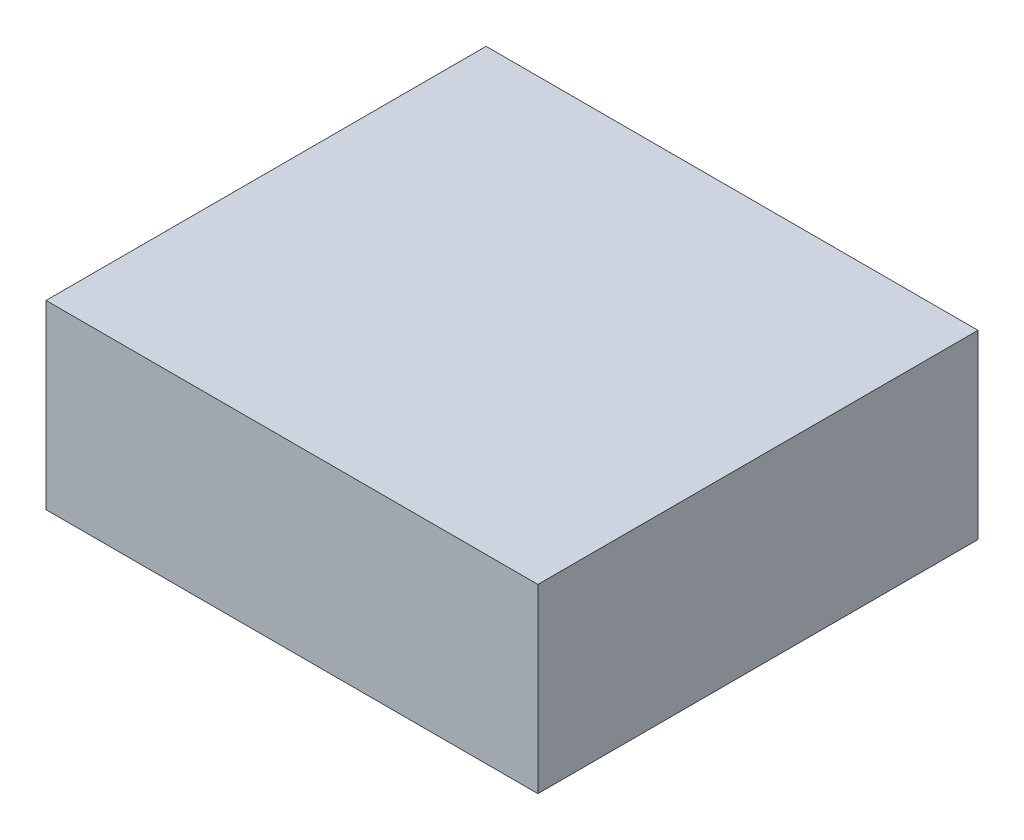
ISO-10303-21;
HEADER;
FILE_DESCRIPTION(('STEP AP214'),'2;1');
FILE_NAME('part.step','',(''),(''),'','','');
FILE_SCHEMA(('AUTOMOTIVE_DESIGN { 1 0 10303 214 1 1 1 1 }'));
ENDSEC;
DATA;
#1=APPLICATION_CONTEXT('core data for automotive mechanical design processes');
#2=APPLICATION_PROTOCOL_DEFINITION('international standard','automotive_design',2000,#1);
#3=PRODUCT_CONTEXT('',#1,'mechanical');
#4=PRODUCT('Part','Part','',(#3));
#5=PRODUCT_RELATED_PRODUCT_CATEGORY('part','',(#4));
#6=PRODUCT_DEFINITION_FORMATION('','',#4);
#7=PRODUCT_DEFINITION_CONTEXT('part definition',#1,'design');
#8=PRODUCT_DEFINITION('design','',#6,#7);
#9=PRODUCT_DEFINITION_SHAPE('','',#8);
#10=(LENGTH_UNIT() NAMED_UNIT(*) SI_UNIT(.MILLI.,.METRE.));
#11=(NAMED_UNIT(*) PLANE_ANGLE_UNIT() SI_UNIT($,.RADIAN.));
#12=(NAMED_UNIT(*) SI_UNIT($,.STERADIAN.) SOLID_ANGLE_UNIT());
#13=UNCERTAINTY_MEASURE_WITH_UNIT(LENGTH_MEASURE(1.E-05),#10,'distance_accuracy_value','');
#14=(GEOMETRIC_REPRESENTATION_CONTEXT(3) GLOBAL_UNCERTAINTY_ASSIGNED_CONTEXT((#13)) GLOBAL_UNIT_ASSIGNED_CONTEXT((#10,
#11,#12)) REPRESENTATION_CONTEXT('',''));
#15=CARTESIAN_POINT('',(0.,0.,0.));
#16=DIRECTION('',(0.,0.,1.));
#17=DIRECTION('',(1.,0.,0.));
#18=AXIS2_PLACEMENT_3D('',#15,#16,#17);
#19=CARTESIAN_POINT('',(-0.47499778,-0.17499838,0.));
#20=DIRECTION('',(0.,1.,0.));
#21=DIRECTION('',(1.,0.,0.));
#22=AXIS2_PLACEMENT_3D('',#19,#20,#21);
#23=PLANE('',#22);
#24=DIRECTION('',(1.,0.,0.));
#25=VECTOR('',#24,1.);
#26=CARTESIAN_POINT('',(-0.47499778,-0.17499838,0.));
#27=LINE('',#26,#25);
#28=CARTESIAN_POINT('',(-0.47499778,-0.17499838,0.));
#29=VERTEX_POINT('',#28);
#30=CARTESIAN_POINT('',(0.47500032,-0.17499838,0.));
#31=VERTEX_POINT('',#30);
#32=EDGE_CURVE('E11',#29,#31,#27,.T.);
#33=ORIENTED_EDGE('',*,*,#32,.T.);
#34=DIRECTION('',(0.,0.,1.));
#35=VECTOR('',#34,1.);
#36=CARTESIAN_POINT('',(0.47500032,-0.17499838,0.));
#37=LINE('',#36,#35);
#38=CARTESIAN_POINT('',(0.47500032,-0.17499838,0.85000084));
#39=VERTEX_POINT('',#38);
#40=EDGE_CURVE('E24',#31,#39,#37,.T.);
#41=ORIENTED_EDGE('',*,*,#40,.T.);
#42=DIRECTION('',(1.,0.,0.));
#43=VECTOR('',#42,1.);
#44=CARTESIAN_POINT('',(-0.47499778,-0.17499838,0.85000084));
#45=LINE('',#44,#43);
#46=CARTESIAN_POINT('',(-0.47499778,-0.17499838,0.85000084));
#47=VERTEX_POINT('',#46);
#48=EDGE_CURVE('E87',#47,#39,#45,.T.);
#49=ORIENTED_EDGE('',*,*,#48,.F.);
#50=DIRECTION('',(0.,0.,1.));
#51=VECTOR('',#50,1.);
#52=CARTESIAN_POINT('',(-0.47499778,-0.17499838,0.));
#53=LINE('',#52,#51);
#54=EDGE_CURVE('E36',#29,#47,#53,.T.);
#55=ORIENTED_EDGE('',*,*,#54,.F.);
#56=EDGE_LOOP('',(#33,#41,#49,#55));
#57=FACE_BOUND('',#56,.T.);
#58=ADVANCED_FACE('F17',(#57),#23,.F.);
#59=CARTESIAN_POINT('',(0.47500032,-0.17499838,0.));
#60=DIRECTION('',(-1.,0.,0.));
#61=DIRECTION('',(0.,1.,0.));
#62=AXIS2_PLACEMENT_3D('',#59,#60,#61);
#63=PLANE('',#62);
#64=DIRECTION('',(0.,1.,0.));
#65=VECTOR('',#64,1.);
#66=CARTESIAN_POINT('',(0.47500032,-0.17499838,0.));
#67=LINE('',#66,#65);
#68=CARTESIAN_POINT('',(0.47500032,0.17500092,0.));
#69=VERTEX_POINT('',#68);
#70=EDGE_CURVE('E84',#31,#69,#67,.T.);
#71=ORIENTED_EDGE('',*,*,#70,.T.);
#72=DIRECTION('',(0.,0.,1.));
#73=VECTOR('',#72,1.);
#74=CARTESIAN_POINT('',(0.47500032,0.17500092,0.));
#75=LINE('',#74,#73);
#76=CARTESIAN_POINT('',(0.47500032,0.17500092,0.85000084));
#77=VERTEX_POINT('',#76);
#78=EDGE_CURVE('E82',#69,#77,#75,.T.);
#79=ORIENTED_EDGE('',*,*,#78,.T.);
#80=DIRECTION('',(0.,1.,0.));
#81=VECTOR('',#80,1.);
#82=CARTESIAN_POINT('',(0.47500032,-0.17499838,0.85000084));
#83=LINE('',#82,#81);
#84=EDGE_CURVE('E62',#39,#77,#83,.T.);
#85=ORIENTED_EDGE('',*,*,#84,.F.);
#86=ORIENTED_EDGE('',*,*,#40,.F.);
#87=EDGE_LOOP('',(#71,#79,#85,#86));
#88=FACE_BOUND('',#87,.T.);
#89=ADVANCED_FACE('F89',(#88),#63,.F.);
#90=CARTESIAN_POINT('',(0.47500032,0.17500092,0.));
#91=DIRECTION('',(0.,-1.,0.));
#92=DIRECTION('',(-1.,0.,0.));
#93=AXIS2_PLACEMENT_3D('',#90,#91,#92);
#94=PLANE('',#93);
#95=DIRECTION('',(-1.,0.,0.));
#96=VECTOR('',#95,1.);
#97=CARTESIAN_POINT('',(0.47500032,0.17500092,0.));
#98=LINE('',#97,#96);
#99=CARTESIAN_POINT('',(-0.47499778,0.17500092,0.));
#100=VERTEX_POINT('',#99);
#101=EDGE_CURVE('E71',#69,#100,#98,.T.);
#102=ORIENTED_EDGE('',*,*,#101,.T.);
#103=DIRECTION('',(0.,0.,1.));
#104=VECTOR('',#103,1.);
#105=CARTESIAN_POINT('',(-0.47499778,0.17500092,0.));
#106=LINE('',#105,#104);
#107=CARTESIAN_POINT('',(-0.47499778,0.17500092,0.85000084));
#108=VERTEX_POINT('',#107);
#109=EDGE_CURVE('E65',#100,#108,#106,.T.);
#110=ORIENTED_EDGE('',*,*,#109,.T.);
#111=DIRECTION('',(-1.,0.,0.));
#112=VECTOR('',#111,1.);
#113=CARTESIAN_POINT('',(0.47500032,0.17500092,0.85000084));
#114=LINE('',#113,#112);
#115=EDGE_CURVE('E57',#77,#108,#114,.T.);
#116=ORIENTED_EDGE('',*,*,#115,.F.);
#117=ORIENTED_EDGE('',*,*,#78,.F.);
#118=EDGE_LOOP('',(#102,#110,#116,#117));
#119=FACE_BOUND('',#118,.T.);
#120=ADVANCED_FACE('F69',(#119),#94,.F.);
#121=CARTESIAN_POINT('',(-0.47499778,0.17500092,0.));
#122=DIRECTION('',(1.,0.,0.));
#123=DIRECTION('',(0.,-1.,0.));
#124=AXIS2_PLACEMENT_3D('',#121,#122,#123);
#125=PLANE('',#124);
#126=DIRECTION('',(0.,-1.,0.));
#127=VECTOR('',#126,1.);
#128=CARTESIAN_POINT('',(-0.47499778,0.17500092,0.));
#129=LINE('',#128,#127);
#130=EDGE_CURVE('E66',#100,#29,#129,.T.);
#131=ORIENTED_EDGE('',*,*,#130,.T.);
#132=ORIENTED_EDGE('',*,*,#54,.T.);
#133=DIRECTION('',(0.,-1.,0.));
#134=VECTOR('',#133,1.);
#135=CARTESIAN_POINT('',(-0.47499778,0.17500092,0.85000084));
#136=LINE('',#135,#134);
#137=EDGE_CURVE('E61',#108,#47,#136,.T.);
#138=ORIENTED_EDGE('',*,*,#137,.F.);
#139=ORIENTED_EDGE('',*,*,#109,.F.);
#140=EDGE_LOOP('',(#131,#132,#138,#139));
#141=FACE_BOUND('',#140,.T.);
#142=ADVANCED_FACE('F76',(#141),#125,.F.);
#143=CARTESIAN_POINT('',(-0.47499778,-0.17499838,0.));
#144=DIRECTION('',(0.,0.,-1.));
#145=DIRECTION('',(-1.,0.,0.));
#146=AXIS2_PLACEMENT_3D('',#143,#144,#145);
#147=PLANE('',#146);
#148=ORIENTED_EDGE('',*,*,#130,.F.);
#149=ORIENTED_EDGE('',*,*,#101,.F.);
#150=ORIENTED_EDGE('',*,*,#70,.F.);
#151=ORIENTED_EDGE('',*,*,#32,.F.);
#152=EDGE_LOOP('',(#148,#149,#150,#151));
#153=FACE_BOUND('',#152,.T.);
#154=ADVANCED_FACE('F91',(#153),#147,.T.);
#155=CARTESIAN_POINT('',(-0.47499778,-0.17499838,0.85000084));
#156=DIRECTION('',(0.,0.,-1.));
#157=DIRECTION('',(-1.,0.,0.));
#158=AXIS2_PLACEMENT_3D('',#155,#156,#157);
#159=PLANE('',#158);
#160=ORIENTED_EDGE('',*,*,#48,.T.);
#161=ORIENTED_EDGE('',*,*,#84,.T.);
#162=ORIENTED_EDGE('',*,*,#115,.T.);
#163=ORIENTED_EDGE('',*,*,#137,.T.);
#164=EDGE_LOOP('',(#160,#161,#162,#163));
#165=FACE_BOUND('',#164,.T.);
#166=ADVANCED_FACE('F59',(#165),#159,.F.);
#167=CLOSED_SHELL('',(#58,#89,#120,#142,#154,#166));
#168=MANIFOLD_SOLID_BREP('B1',#167);
#169=ADVANCED_BREP_SHAPE_REPRESENTATION('',(#18,#168),#14);
#170=SHAPE_DEFINITION_REPRESENTATION(#9,#169);
ENDSEC;
END-ISO-10303-21;
